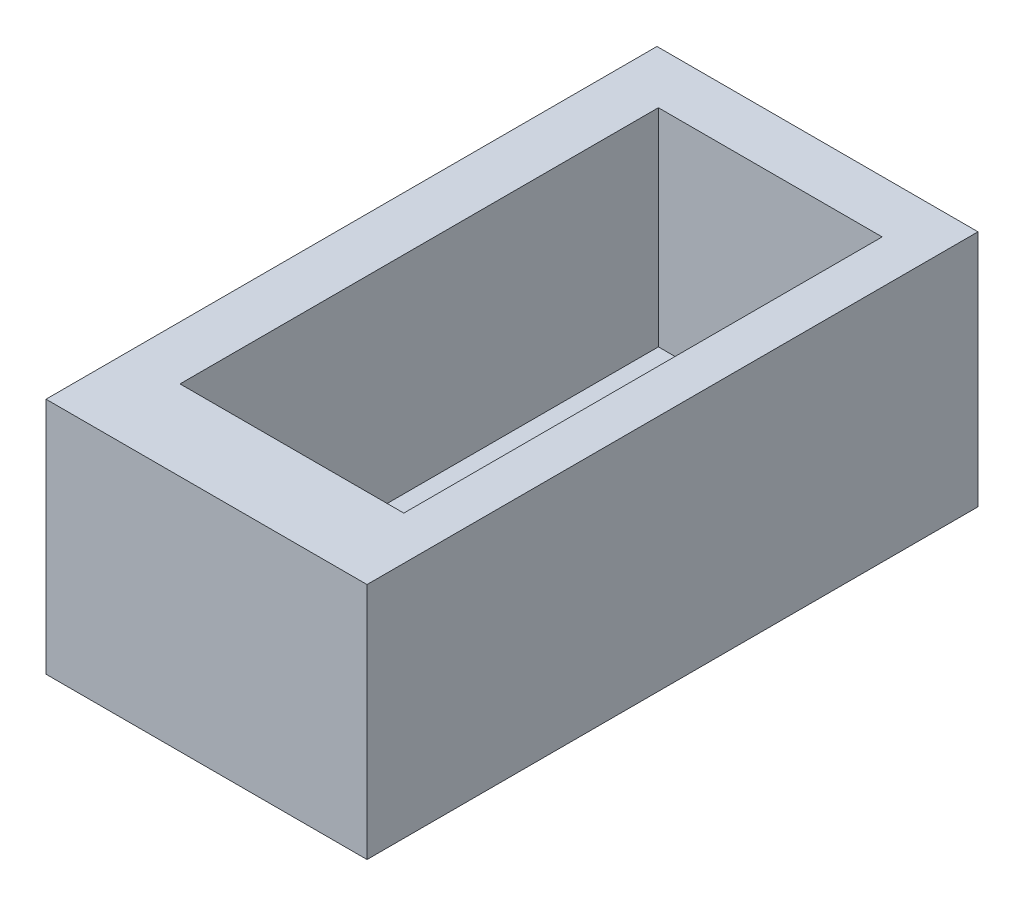
ISO-10303-21;
HEADER;
FILE_DESCRIPTION(('STEP AP214'),'2;1');
FILE_NAME('part.step','',(''),(''),'','','');
FILE_SCHEMA(('AUTOMOTIVE_DESIGN { 1 0 10303 214 1 1 1 1 }'));
ENDSEC;
DATA;
#1=APPLICATION_CONTEXT('core data for automotive mechanical design processes');
#2=APPLICATION_PROTOCOL_DEFINITION('international standard','automotive_design',2000,#1);
#3=PRODUCT_CONTEXT('',#1,'mechanical');
#4=PRODUCT('Part','Part','',(#3));
#5=PRODUCT_RELATED_PRODUCT_CATEGORY('part','',(#4));
#6=PRODUCT_DEFINITION_FORMATION('','',#4);
#7=PRODUCT_DEFINITION_CONTEXT('part definition',#1,'design');
#8=PRODUCT_DEFINITION('design','',#6,#7);
#9=PRODUCT_DEFINITION_SHAPE('','',#8);
#10=(LENGTH_UNIT() NAMED_UNIT(*) SI_UNIT(.MILLI.,.METRE.));
#11=(NAMED_UNIT(*) PLANE_ANGLE_UNIT() SI_UNIT($,.RADIAN.));
#12=(NAMED_UNIT(*) SI_UNIT($,.STERADIAN.) SOLID_ANGLE_UNIT());
#13=UNCERTAINTY_MEASURE_WITH_UNIT(LENGTH_MEASURE(1.E-05),#10,'distance_accuracy_value','');
#14=(GEOMETRIC_REPRESENTATION_CONTEXT(3) GLOBAL_UNCERTAINTY_ASSIGNED_CONTEXT((#13)) GLOBAL_UNIT_ASSIGNED_CONTEXT((#10,
#11,#12)) REPRESENTATION_CONTEXT('',''));
#15=CARTESIAN_POINT('',(0.,0.,0.));
#16=DIRECTION('',(0.,0.,1.));
#17=DIRECTION('',(1.,0.,0.));
#18=AXIS2_PLACEMENT_3D('',#15,#16,#17);
#19=CARTESIAN_POINT('',(-15.5,23.,29.5));
#20=DIRECTION('',(1.,0.,0.));
#21=DIRECTION('',(0.,0.,-1.));
#22=AXIS2_PLACEMENT_3D('',#19,#20,#21);
#23=PLANE('',#22);
#24=DIRECTION('',(0.,0.,1.));
#25=VECTOR('',#24,1.);
#26=CARTESIAN_POINT('',(-15.5,0.,29.5));
#27=LINE('',#26,#25);
#28=CARTESIAN_POINT('',(-15.5,0.,-29.5));
#29=VERTEX_POINT('',#28);
#30=CARTESIAN_POINT('',(-15.5,0.,29.5));
#31=VERTEX_POINT('',#30);
#32=EDGE_CURVE('E145',#29,#31,#27,.T.);
#33=ORIENTED_EDGE('',*,*,#32,.T.);
#34=DIRECTION('',(0.,-1.,0.));
#35=VECTOR('',#34,1.);
#36=CARTESIAN_POINT('',(-15.5,23.,29.5));
#37=LINE('',#36,#35);
#38=CARTESIAN_POINT('',(-15.5,23.,29.5));
#39=VERTEX_POINT('',#38);
#40=EDGE_CURVE('E11',#39,#31,#37,.T.);
#41=ORIENTED_EDGE('',*,*,#40,.F.);
#42=DIRECTION('',(0.,0.,1.));
#43=VECTOR('',#42,1.);
#44=CARTESIAN_POINT('',(-15.5,23.,29.5));
#45=LINE('',#44,#43);
#46=CARTESIAN_POINT('',(-15.5,23.,-29.5));
#47=VERTEX_POINT('',#46);
#48=EDGE_CURVE('E149',#47,#39,#45,.T.);
#49=ORIENTED_EDGE('',*,*,#48,.F.);
#50=DIRECTION('',(0.,-1.,0.));
#51=VECTOR('',#50,1.);
#52=CARTESIAN_POINT('',(-15.5,23.,-29.5));
#53=LINE('',#52,#51);
#54=EDGE_CURVE('E155',#47,#29,#53,.T.);
#55=ORIENTED_EDGE('',*,*,#54,.T.);
#56=EDGE_LOOP('',(#33,#41,#49,#55));
#57=FACE_BOUND('',#56,.T.);
#58=ADVANCED_FACE('F37',(#57),#23,.F.);
#59=CARTESIAN_POINT('',(15.5,23.,29.5));
#60=DIRECTION('',(0.,0.,-1.));
#61=DIRECTION('',(-1.,0.,0.));
#62=AXIS2_PLACEMENT_3D('',#59,#60,#61);
#63=PLANE('',#62);
#64=DIRECTION('',(1.,0.,0.));
#65=VECTOR('',#64,1.);
#66=CARTESIAN_POINT('',(15.5,0.,29.5));
#67=LINE('',#66,#65);
#68=CARTESIAN_POINT('',(15.5,0.,29.5));
#69=VERTEX_POINT('',#68);
#70=EDGE_CURVE('E158',#31,#69,#67,.T.);
#71=ORIENTED_EDGE('',*,*,#70,.T.);
#72=DIRECTION('',(0.,-1.,0.));
#73=VECTOR('',#72,1.);
#74=CARTESIAN_POINT('',(15.5,23.,29.5));
#75=LINE('',#74,#73);
#76=CARTESIAN_POINT('',(15.5,23.,29.5));
#77=VERTEX_POINT('',#76);
#78=EDGE_CURVE('E44',#77,#69,#75,.T.);
#79=ORIENTED_EDGE('',*,*,#78,.F.);
#80=DIRECTION('',(1.,0.,0.));
#81=VECTOR('',#80,1.);
#82=CARTESIAN_POINT('',(15.5,23.,29.5));
#83=LINE('',#82,#81);
#84=EDGE_CURVE('E88',#39,#77,#83,.T.);
#85=ORIENTED_EDGE('',*,*,#84,.F.);
#86=ORIENTED_EDGE('',*,*,#40,.T.);
#87=EDGE_LOOP('',(#71,#79,#85,#86));
#88=FACE_BOUND('',#87,.T.);
#89=ADVANCED_FACE('F187',(#88),#63,.F.);
#90=CARTESIAN_POINT('',(15.5,23.,29.5));
#91=DIRECTION('',(-1.,0.,0.));
#92=DIRECTION('',(0.,0.,1.));
#93=AXIS2_PLACEMENT_3D('',#90,#91,#92);
#94=PLANE('',#93);
#95=DIRECTION('',(0.,0.,-1.));
#96=VECTOR('',#95,1.);
#97=CARTESIAN_POINT('',(15.5,0.,29.5));
#98=LINE('',#97,#96);
#99=CARTESIAN_POINT('',(15.5,0.,-29.5));
#100=VERTEX_POINT('',#99);
#101=EDGE_CURVE('E160',#69,#100,#98,.T.);
#102=ORIENTED_EDGE('',*,*,#101,.T.);
#103=DIRECTION('',(0.,-1.,0.));
#104=VECTOR('',#103,1.);
#105=CARTESIAN_POINT('',(15.5,23.,-29.5));
#106=LINE('',#105,#104);
#107=CARTESIAN_POINT('',(15.5,23.,-29.5));
#108=VERTEX_POINT('',#107);
#109=EDGE_CURVE('E164',#108,#100,#106,.T.);
#110=ORIENTED_EDGE('',*,*,#109,.F.);
#111=DIRECTION('',(0.,0.,-1.));
#112=VECTOR('',#111,1.);
#113=CARTESIAN_POINT('',(15.5,23.,29.5));
#114=LINE('',#113,#112);
#115=EDGE_CURVE('E152',#77,#108,#114,.T.);
#116=ORIENTED_EDGE('',*,*,#115,.F.);
#117=ORIENTED_EDGE('',*,*,#78,.T.);
#118=EDGE_LOOP('',(#102,#110,#116,#117));
#119=FACE_BOUND('',#118,.T.);
#120=ADVANCED_FACE('F169',(#119),#94,.F.);
#121=CARTESIAN_POINT('',(15.5,23.,-29.5));
#122=DIRECTION('',(0.,0.,1.));
#123=DIRECTION('',(1.,0.,0.));
#124=AXIS2_PLACEMENT_3D('',#121,#122,#123);
#125=PLANE('',#124);
#126=DIRECTION('',(-1.,0.,0.));
#127=VECTOR('',#126,1.);
#128=CARTESIAN_POINT('',(15.5,0.,-29.5));
#129=LINE('',#128,#127);
#130=EDGE_CURVE('E81',#100,#29,#129,.T.);
#131=ORIENTED_EDGE('',*,*,#130,.T.);
#132=ORIENTED_EDGE('',*,*,#54,.F.);
#133=DIRECTION('',(-1.,0.,0.));
#134=VECTOR('',#133,1.);
#135=CARTESIAN_POINT('',(15.5,23.,-29.5));
#136=LINE('',#135,#134);
#137=EDGE_CURVE('E60',#108,#47,#136,.T.);
#138=ORIENTED_EDGE('',*,*,#137,.F.);
#139=ORIENTED_EDGE('',*,*,#109,.T.);
#140=EDGE_LOOP('',(#131,#132,#138,#139));
#141=FACE_BOUND('',#140,.T.);
#142=ADVANCED_FACE('F177',(#141),#125,.F.);
#143=CARTESIAN_POINT('',(0.,23.,0.));
#144=DIRECTION('',(0.,1.,0.));
#145=DIRECTION('',(0.,0.,1.));
#146=AXIS2_PLACEMENT_3D('',#143,#144,#145);
#147=PLANE('',#146);
#148=DIRECTION('',(0.,0.,1.));
#149=VECTOR('',#148,1.);
#150=CARTESIAN_POINT('',(-10.3074651415298,23.,-24.4444253245888));
#151=LINE('',#150,#149);
#152=CARTESIAN_POINT('',(-10.3074651415298,23.,-24.4444253245888));
#153=VERTEX_POINT('',#152);
#154=CARTESIAN_POINT('',(-10.3074651415298,23.,21.749943455478));
#155=VERTEX_POINT('',#154);
#156=EDGE_CURVE('E51',#153,#155,#151,.T.);
#157=ORIENTED_EDGE('',*,*,#156,.F.);
#158=DIRECTION('',(-1.,0.,0.));
#159=VECTOR('',#158,1.);
#160=CARTESIAN_POINT('',(-10.3074651415298,23.,-24.4444253245888));
#161=LINE('',#160,#159);
#162=CARTESIAN_POINT('',(11.3017315139032,23.,-24.4444253245888));
#163=VERTEX_POINT('',#162);
#164=EDGE_CURVE('E130',#163,#153,#161,.T.);
#165=ORIENTED_EDGE('',*,*,#164,.F.);
#166=DIRECTION('',(0.,0.,-1.));
#167=VECTOR('',#166,1.);
#168=CARTESIAN_POINT('',(11.3017315139032,23.,-24.4444253245888));
#169=LINE('',#168,#167);
#170=CARTESIAN_POINT('',(11.3017315139032,23.,21.749943455478));
#171=VERTEX_POINT('',#170);
#172=EDGE_CURVE('E133',#171,#163,#169,.T.);
#173=ORIENTED_EDGE('',*,*,#172,.F.);
#174=DIRECTION('',(1.,0.,0.));
#175=VECTOR('',#174,1.);
#176=CARTESIAN_POINT('',(-10.3074651415298,23.,21.749943455478));
#177=LINE('',#176,#175);
#178=EDGE_CURVE('E139',#155,#171,#177,.T.);
#179=ORIENTED_EDGE('',*,*,#178,.F.);
#180=EDGE_LOOP('',(#157,#165,#173,#179));
#181=FACE_BOUND('',#180,.T.);
#182=ORIENTED_EDGE('',*,*,#48,.T.);
#183=ORIENTED_EDGE('',*,*,#84,.T.);
#184=ORIENTED_EDGE('',*,*,#115,.T.);
#185=ORIENTED_EDGE('',*,*,#137,.T.);
#186=EDGE_LOOP('',(#182,#183,#184,#185));
#187=FACE_BOUND('',#186,.T.);
#188=ADVANCED_FACE('F179',(#181,#187),#147,.T.);
#189=CARTESIAN_POINT('',(0.,0.,0.));
#190=DIRECTION('',(0.,1.,0.));
#191=DIRECTION('',(0.,0.,1.));
#192=AXIS2_PLACEMENT_3D('',#189,#190,#191);
#193=PLANE('',#192);
#194=ORIENTED_EDGE('',*,*,#32,.F.);
#195=ORIENTED_EDGE('',*,*,#130,.F.);
#196=ORIENTED_EDGE('',*,*,#101,.F.);
#197=ORIENTED_EDGE('',*,*,#70,.F.);
#198=EDGE_LOOP('',(#194,#195,#196,#197));
#199=FACE_BOUND('',#198,.T.);
#200=ADVANCED_FACE('F173',(#199),#193,.F.);
#201=CARTESIAN_POINT('',(-10.3074651415298,3.,-24.4444253245888));
#202=DIRECTION('',(-1.,0.,0.));
#203=DIRECTION('',(0.,0.,1.));
#204=AXIS2_PLACEMENT_3D('',#201,#202,#203);
#205=PLANE('',#204);
#206=ORIENTED_EDGE('',*,*,#156,.T.);
#207=DIRECTION('',(0.,1.,0.));
#208=VECTOR('',#207,1.);
#209=CARTESIAN_POINT('',(-10.3074651415298,3.,21.749943455478));
#210=LINE('',#209,#208);
#211=CARTESIAN_POINT('',(-10.3074651415298,3.,21.749943455478));
#212=VERTEX_POINT('',#211);
#213=EDGE_CURVE('E108',#212,#155,#210,.T.);
#214=ORIENTED_EDGE('',*,*,#213,.F.);
#215=DIRECTION('',(0.,0.,1.));
#216=VECTOR('',#215,1.);
#217=CARTESIAN_POINT('',(-10.3074651415298,3.,-24.4444253245888));
#218=LINE('',#217,#216);
#219=CARTESIAN_POINT('',(-10.3074651415298,3.,-24.4444253245888));
#220=VERTEX_POINT('',#219);
#221=EDGE_CURVE('E112',#220,#212,#218,.T.);
#222=ORIENTED_EDGE('',*,*,#221,.F.);
#223=DIRECTION('',(0.,1.,0.));
#224=VECTOR('',#223,1.);
#225=CARTESIAN_POINT('',(-10.3074651415298,3.,-24.4444253245888));
#226=LINE('',#225,#224);
#227=EDGE_CURVE('E143',#220,#153,#226,.T.);
#228=ORIENTED_EDGE('',*,*,#227,.T.);
#229=EDGE_LOOP('',(#206,#214,#222,#228));
#230=FACE_BOUND('',#229,.T.);
#231=ADVANCED_FACE('F110',(#230),#205,.F.);
#232=CARTESIAN_POINT('',(-10.3074651415298,3.,-24.4444253245888));
#233=DIRECTION('',(0.,0.,-1.));
#234=DIRECTION('',(-1.,0.,0.));
#235=AXIS2_PLACEMENT_3D('',#232,#233,#234);
#236=PLANE('',#235);
#237=ORIENTED_EDGE('',*,*,#164,.T.);
#238=ORIENTED_EDGE('',*,*,#227,.F.);
#239=DIRECTION('',(-1.,0.,0.));
#240=VECTOR('',#239,1.);
#241=CARTESIAN_POINT('',(-10.3074651415298,3.,-24.4444253245888));
#242=LINE('',#241,#240);
#243=CARTESIAN_POINT('',(11.3017315139032,3.,-24.4444253245888));
#244=VERTEX_POINT('',#243);
#245=EDGE_CURVE('E118',#244,#220,#242,.T.);
#246=ORIENTED_EDGE('',*,*,#245,.F.);
#247=DIRECTION('',(0.,1.,0.));
#248=VECTOR('',#247,1.);
#249=CARTESIAN_POINT('',(11.3017315139032,3.,-24.4444253245888));
#250=LINE('',#249,#248);
#251=EDGE_CURVE('E146',#244,#163,#250,.T.);
#252=ORIENTED_EDGE('',*,*,#251,.T.);
#253=EDGE_LOOP('',(#237,#238,#246,#252));
#254=FACE_BOUND('',#253,.T.);
#255=ADVANCED_FACE('F226',(#254),#236,.F.);
#256=CARTESIAN_POINT('',(11.3017315139032,3.,-24.4444253245888));
#257=DIRECTION('',(1.,0.,0.));
#258=DIRECTION('',(0.,0.,-1.));
#259=AXIS2_PLACEMENT_3D('',#256,#257,#258);
#260=PLANE('',#259);
#261=ORIENTED_EDGE('',*,*,#172,.T.);
#262=ORIENTED_EDGE('',*,*,#251,.F.);
#263=DIRECTION('',(0.,0.,-1.));
#264=VECTOR('',#263,1.);
#265=CARTESIAN_POINT('',(11.3017315139032,3.,-24.4444253245888));
#266=LINE('',#265,#264);
#267=CARTESIAN_POINT('',(11.3017315139032,3.,21.749943455478));
#268=VERTEX_POINT('',#267);
#269=EDGE_CURVE('E126',#268,#244,#266,.T.);
#270=ORIENTED_EDGE('',*,*,#269,.F.);
#271=DIRECTION('',(0.,1.,0.));
#272=VECTOR('',#271,1.);
#273=CARTESIAN_POINT('',(11.3017315139032,3.,21.749943455478));
#274=LINE('',#273,#272);
#275=EDGE_CURVE('E117',#268,#171,#274,.T.);
#276=ORIENTED_EDGE('',*,*,#275,.T.);
#277=EDGE_LOOP('',(#261,#262,#270,#276));
#278=FACE_BOUND('',#277,.T.);
#279=ADVANCED_FACE('F235',(#278),#260,.F.);
#280=CARTESIAN_POINT('',(-10.3074651415298,3.,21.749943455478));
#281=DIRECTION('',(0.,0.,1.));
#282=DIRECTION('',(1.,0.,0.));
#283=AXIS2_PLACEMENT_3D('',#280,#281,#282);
#284=PLANE('',#283);
#285=ORIENTED_EDGE('',*,*,#178,.T.);
#286=ORIENTED_EDGE('',*,*,#275,.F.);
#287=DIRECTION('',(1.,0.,0.));
#288=VECTOR('',#287,1.);
#289=CARTESIAN_POINT('',(-10.3074651415298,3.,21.749943455478));
#290=LINE('',#289,#288);
#291=EDGE_CURVE('E121',#212,#268,#290,.T.);
#292=ORIENTED_EDGE('',*,*,#291,.F.);
#293=ORIENTED_EDGE('',*,*,#213,.T.);
#294=EDGE_LOOP('',(#285,#286,#292,#293));
#295=FACE_BOUND('',#294,.T.);
#296=ADVANCED_FACE('F122',(#295),#284,.F.);
#297=CARTESIAN_POINT('',(0.,3.,0.));
#298=DIRECTION('',(0.,1.,0.));
#299=DIRECTION('',(0.,0.,1.));
#300=AXIS2_PLACEMENT_3D('',#297,#298,#299);
#301=PLANE('',#300);
#302=ORIENTED_EDGE('',*,*,#221,.T.);
#303=ORIENTED_EDGE('',*,*,#291,.T.);
#304=ORIENTED_EDGE('',*,*,#269,.T.);
#305=ORIENTED_EDGE('',*,*,#245,.T.);
#306=EDGE_LOOP('',(#302,#303,#304,#305));
#307=FACE_BOUND('',#306,.T.);
#308=ADVANCED_FACE('F128',(#307),#301,.T.);
#309=CLOSED_SHELL('',(#58,#89,#120,#142,#188,#200,#231,#255,#279,#296,#308));
#310=MANIFOLD_SOLID_BREP('B2',#309);
#311=ADVANCED_BREP_SHAPE_REPRESENTATION('',(#18,#310),#14);
#312=SHAPE_DEFINITION_REPRESENTATION(#9,#311);
ENDSEC;
END-ISO-10303-21;
